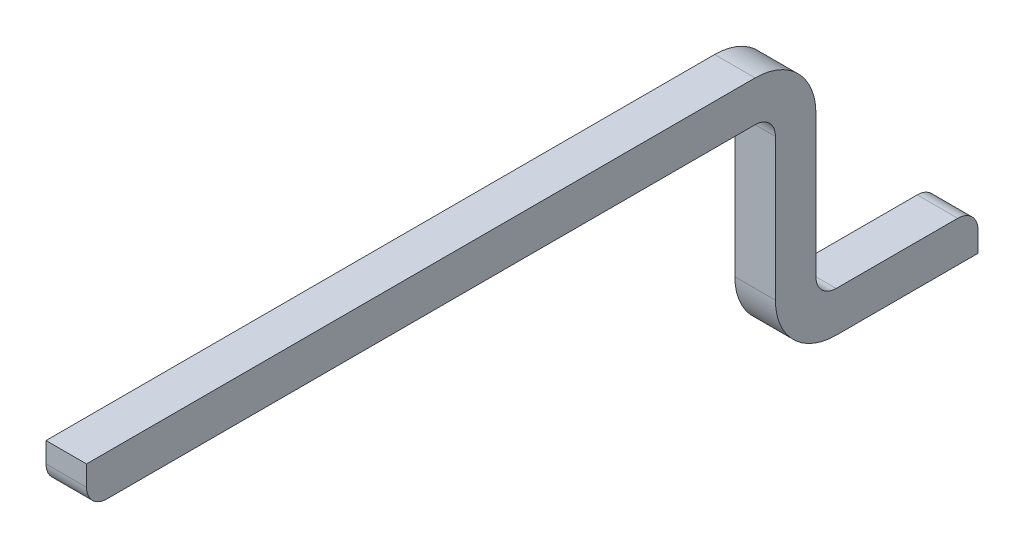
ISO-10303-21;
HEADER;
FILE_DESCRIPTION(('STEP AP214'),'2;1');
FILE_NAME('part.step','',(''),(''),'','','');
FILE_SCHEMA(('AUTOMOTIVE_DESIGN { 1 0 10303 214 1 1 1 1 }'));
ENDSEC;
DATA;
#1=APPLICATION_CONTEXT('core data for automotive mechanical design processes');
#2=APPLICATION_PROTOCOL_DEFINITION('international standard','automotive_design',2000,#1);
#3=PRODUCT_CONTEXT('',#1,'mechanical');
#4=PRODUCT('Part','Part','',(#3));
#5=PRODUCT_RELATED_PRODUCT_CATEGORY('part','',(#4));
#6=PRODUCT_DEFINITION_FORMATION('','',#4);
#7=PRODUCT_DEFINITION_CONTEXT('part definition',#1,'design');
#8=PRODUCT_DEFINITION('design','',#6,#7);
#9=PRODUCT_DEFINITION_SHAPE('','',#8);
#10=(LENGTH_UNIT() NAMED_UNIT(*) SI_UNIT(.MILLI.,.METRE.));
#11=(NAMED_UNIT(*) PLANE_ANGLE_UNIT() SI_UNIT($,.RADIAN.));
#12=(NAMED_UNIT(*) SI_UNIT($,.STERADIAN.) SOLID_ANGLE_UNIT());
#13=UNCERTAINTY_MEASURE_WITH_UNIT(LENGTH_MEASURE(1.E-05),#10,'distance_accuracy_value','');
#14=(GEOMETRIC_REPRESENTATION_CONTEXT(3) GLOBAL_UNCERTAINTY_ASSIGNED_CONTEXT((#13)) GLOBAL_UNIT_ASSIGNED_CONTEXT((#10,
#11,#12)) REPRESENTATION_CONTEXT('',''));
#15=CARTESIAN_POINT('',(0.,0.,0.));
#16=DIRECTION('',(0.,0.,1.));
#17=DIRECTION('',(1.,0.,0.));
#18=AXIS2_PLACEMENT_3D('',#15,#16,#17);
#19=CARTESIAN_POINT('',(0.1,0.3,-4.5));
#20=DIRECTION('',(1.,0.,0.));
#21=DIRECTION('',(0.,0.,-1.));
#22=AXIS2_PLACEMENT_3D('',#19,#20,#21);
#23=PLANE('',#22);
#24=CARTESIAN_POINT('',(0.1,0.3,-4.5));
#25=DIRECTION('',(-1.,0.,0.));
#26=DIRECTION('',(0.,0.,1.));
#27=AXIS2_PLACEMENT_3D('',#24,#25,#26);
#28=CIRCLE('',#27,0.3);
#29=CARTESIAN_POINT('',(0.1,0.3,-4.2));
#30=VERTEX_POINT('',#29);
#31=CARTESIAN_POINT('',(0.1,0.,-4.5));
#32=VERTEX_POINT('',#31);
#33=EDGE_CURVE('E240',#30,#32,#28,.F.);
#34=ORIENTED_EDGE('',*,*,#33,.T.);
#35=DIRECTION('',(0.,0.,-1.));
#36=VECTOR('',#35,1.);
#37=CARTESIAN_POINT('',(0.1,0.,-4.5));
#38=LINE('',#37,#36);
#39=CARTESIAN_POINT('',(0.1,0.,-5.2));
#40=VERTEX_POINT('',#39);
#41=EDGE_CURVE('E112',#32,#40,#38,.T.);
#42=ORIENTED_EDGE('',*,*,#41,.T.);
#43=DIRECTION('',(0.,1.,0.));
#44=VECTOR('',#43,1.);
#45=CARTESIAN_POINT('',(0.1,0.3,-5.2));
#46=LINE('',#45,#44);
#47=CARTESIAN_POINT('',(0.1,0.1,-5.2));
#48=VERTEX_POINT('',#47);
#49=EDGE_CURVE('E109',#40,#48,#46,.T.);
#50=ORIENTED_EDGE('',*,*,#49,.T.);
#51=CARTESIAN_POINT('',(0.1,0.1,-5.1));
#52=DIRECTION('',(-1.,0.,0.));
#53=DIRECTION('',(0.,0.,1.));
#54=AXIS2_PLACEMENT_3D('',#51,#52,#53);
#55=CIRCLE('',#54,0.1);
#56=CARTESIAN_POINT('',(0.1,0.2,-5.1));
#57=VERTEX_POINT('',#56);
#58=EDGE_CURVE('E19',#48,#57,#55,.F.);
#59=ORIENTED_EDGE('',*,*,#58,.T.);
#60=DIRECTION('',(0.,0.,-1.));
#61=VECTOR('',#60,1.);
#62=CARTESIAN_POINT('',(0.1,0.2,-4.5));
#63=LINE('',#62,#61);
#64=CARTESIAN_POINT('',(0.1,0.2,-4.5));
#65=VERTEX_POINT('',#64);
#66=EDGE_CURVE('E247',#57,#65,#63,.F.);
#67=ORIENTED_EDGE('',*,*,#66,.T.);
#68=CARTESIAN_POINT('',(0.1,0.3,-4.5));
#69=DIRECTION('',(-1.,0.,0.));
#70=DIRECTION('',(0.,0.,1.));
#71=AXIS2_PLACEMENT_3D('',#68,#69,#70);
#72=CIRCLE('',#71,0.1);
#73=CARTESIAN_POINT('',(0.1,0.3,-4.4));
#74=VERTEX_POINT('',#73);
#75=EDGE_CURVE('E239',#65,#74,#72,.T.);
#76=ORIENTED_EDGE('',*,*,#75,.T.);
#77=DIRECTION('',(0.,1.,0.));
#78=VECTOR('',#77,1.);
#79=CARTESIAN_POINT('',(0.1,1.,-4.4));
#80=LINE('',#79,#78);
#81=CARTESIAN_POINT('',(0.1,1.,-4.4));
#82=VERTEX_POINT('',#81);
#83=EDGE_CURVE('E233',#82,#74,#80,.F.);
#84=ORIENTED_EDGE('',*,*,#83,.F.);
#85=CARTESIAN_POINT('',(0.1,1.,-4.1));
#86=DIRECTION('',(-1.,0.,0.));
#87=DIRECTION('',(0.,0.,1.));
#88=AXIS2_PLACEMENT_3D('',#85,#86,#87);
#89=CIRCLE('',#88,0.3);
#90=CARTESIAN_POINT('',(0.1,1.3,-4.1));
#91=VERTEX_POINT('',#90);
#92=EDGE_CURVE('E229',#91,#82,#89,.T.);
#93=ORIENTED_EDGE('',*,*,#92,.F.);
#94=DIRECTION('',(0.,0.,1.));
#95=VECTOR('',#94,1.);
#96=CARTESIAN_POINT('',(0.1,1.3,-0.8));
#97=LINE('',#96,#95);
#98=CARTESIAN_POINT('',(0.1,1.3,-0.8));
#99=VERTEX_POINT('',#98);
#100=EDGE_CURVE('E225',#99,#91,#97,.F.);
#101=ORIENTED_EDGE('',*,*,#100,.F.);
#102=DIRECTION('',(0.,-1.,0.));
#103=VECTOR('',#102,1.);
#104=CARTESIAN_POINT('',(0.1,1.1,-0.8));
#105=LINE('',#104,#103);
#106=CARTESIAN_POINT('',(0.1,1.2,-0.8));
#107=VERTEX_POINT('',#106);
#108=EDGE_CURVE('E219',#107,#99,#105,.F.);
#109=ORIENTED_EDGE('',*,*,#108,.F.);
#110=CARTESIAN_POINT('',(0.1,1.2,-0.9));
#111=DIRECTION('',(1.,0.,0.));
#112=DIRECTION('',(0.,0.,-1.));
#113=AXIS2_PLACEMENT_3D('',#110,#111,#112);
#114=CIRCLE('',#113,0.1);
#115=CARTESIAN_POINT('',(0.1,1.1,-0.9));
#116=VERTEX_POINT('',#115);
#117=EDGE_CURVE('E215',#116,#107,#114,.F.);
#118=ORIENTED_EDGE('',*,*,#117,.F.);
#119=DIRECTION('',(0.,0.,1.));
#120=VECTOR('',#119,1.);
#121=CARTESIAN_POINT('',(0.1,1.1,-0.8));
#122=LINE('',#121,#120);
#123=CARTESIAN_POINT('',(0.1,1.1,-4.1));
#124=VERTEX_POINT('',#123);
#125=EDGE_CURVE('E207',#116,#124,#122,.F.);
#126=ORIENTED_EDGE('',*,*,#125,.T.);
#127=CARTESIAN_POINT('',(0.1,1.,-4.1));
#128=DIRECTION('',(-1.,0.,0.));
#129=DIRECTION('',(0.,0.,1.));
#130=AXIS2_PLACEMENT_3D('',#127,#128,#129);
#131=CIRCLE('',#130,0.1);
#132=CARTESIAN_POINT('',(0.1,1.,-4.2));
#133=VERTEX_POINT('',#132);
#134=EDGE_CURVE('E246',#124,#133,#131,.T.);
#135=ORIENTED_EDGE('',*,*,#134,.T.);
#136=DIRECTION('',(0.,1.,0.));
#137=VECTOR('',#136,1.);
#138=CARTESIAN_POINT('',(0.1,0.3,-4.2));
#139=LINE('',#138,#137);
#140=EDGE_CURVE('E243',#133,#30,#139,.F.);
#141=ORIENTED_EDGE('',*,*,#140,.T.);
#142=EDGE_LOOP('',(#34,#42,#50,#59,#67,#76,#84,#93,#101,#109,#118,#126,#135,#141));
#143=FACE_BOUND('',#142,.T.);
#144=ADVANCED_FACE('F16',(#143),#23,.T.);
#145=CARTESIAN_POINT('',(0.1,0.3,-4.5));
#146=DIRECTION('',(-1.,0.,0.));
#147=DIRECTION('',(0.,0.,1.));
#148=AXIS2_PLACEMENT_3D('',#145,#146,#147);
#149=CYLINDRICAL_SURFACE('',#148,0.1);
#150=DIRECTION('',(-1.,0.,0.));
#151=VECTOR('',#150,1.);
#152=CARTESIAN_POINT('',(0.1,0.3,-4.4));
#153=LINE('',#152,#151);
#154=CARTESIAN_POINT('',(-0.1,0.3,-4.4));
#155=VERTEX_POINT('',#154);
#156=EDGE_CURVE('E230',#74,#155,#153,.T.);
#157=ORIENTED_EDGE('',*,*,#156,.F.);
#158=ORIENTED_EDGE('',*,*,#75,.F.);
#159=DIRECTION('',(1.,0.,0.));
#160=VECTOR('',#159,1.);
#161=CARTESIAN_POINT('',(0.1,0.2,-4.5));
#162=LINE('',#161,#160);
#163=CARTESIAN_POINT('',(-0.1,0.2,-4.5));
#164=VERTEX_POINT('',#163);
#165=EDGE_CURVE('E186',#164,#65,#162,.T.);
#166=ORIENTED_EDGE('',*,*,#165,.F.);
#167=CARTESIAN_POINT('',(-0.1,0.3,-4.5));
#168=DIRECTION('',(-1.,0.,0.));
#169=DIRECTION('',(0.,0.,1.));
#170=AXIS2_PLACEMENT_3D('',#167,#168,#169);
#171=CIRCLE('',#170,0.1);
#172=EDGE_CURVE('E183',#164,#155,#171,.T.);
#173=ORIENTED_EDGE('',*,*,#172,.T.);
#174=EDGE_LOOP('',(#157,#158,#166,#173));
#175=FACE_BOUND('',#174,.T.);
#176=ADVANCED_FACE('F327',(#175),#149,.F.);
#177=CARTESIAN_POINT('',(0.1,1.,-4.4));
#178=DIRECTION('',(0.,0.,-1.));
#179=DIRECTION('',(-1.,0.,0.));
#180=AXIS2_PLACEMENT_3D('',#177,#178,#179);
#181=PLANE('',#180);
#182=ORIENTED_EDGE('',*,*,#83,.T.);
#183=ORIENTED_EDGE('',*,*,#156,.T.);
#184=DIRECTION('',(0.,1.,0.));
#185=VECTOR('',#184,1.);
#186=CARTESIAN_POINT('',(-0.1,0.3,-4.4));
#187=LINE('',#186,#185);
#188=CARTESIAN_POINT('',(-0.1,1.,-4.4));
#189=VERTEX_POINT('',#188);
#190=EDGE_CURVE('E180',#155,#189,#187,.T.);
#191=ORIENTED_EDGE('',*,*,#190,.T.);
#192=DIRECTION('',(-1.,0.,0.));
#193=VECTOR('',#192,1.);
#194=CARTESIAN_POINT('',(0.1,1.,-4.4));
#195=LINE('',#194,#193);
#196=EDGE_CURVE('E226',#82,#189,#195,.T.);
#197=ORIENTED_EDGE('',*,*,#196,.F.);
#198=EDGE_LOOP('',(#182,#183,#191,#197));
#199=FACE_BOUND('',#198,.T.);
#200=ADVANCED_FACE('F323',(#199),#181,.T.);
#201=CARTESIAN_POINT('',(0.1,1.,-4.1));
#202=DIRECTION('',(-1.,0.,0.));
#203=DIRECTION('',(0.,0.,1.));
#204=AXIS2_PLACEMENT_3D('',#201,#202,#203);
#205=CYLINDRICAL_SURFACE('',#204,0.3);
#206=ORIENTED_EDGE('',*,*,#92,.T.);
#207=ORIENTED_EDGE('',*,*,#196,.T.);
#208=CARTESIAN_POINT('',(-0.1,1.,-4.1));
#209=DIRECTION('',(-1.,0.,0.));
#210=DIRECTION('',(0.,0.,1.));
#211=AXIS2_PLACEMENT_3D('',#208,#209,#210);
#212=CIRCLE('',#211,0.3);
#213=CARTESIAN_POINT('',(-0.1,1.3,-4.1));
#214=VERTEX_POINT('',#213);
#215=EDGE_CURVE('E177',#189,#214,#212,.F.);
#216=ORIENTED_EDGE('',*,*,#215,.T.);
#217=DIRECTION('',(1.,0.,0.));
#218=VECTOR('',#217,1.);
#219=CARTESIAN_POINT('',(0.1,1.3,-4.1));
#220=LINE('',#219,#218);
#221=EDGE_CURVE('E222',#91,#214,#220,.F.);
#222=ORIENTED_EDGE('',*,*,#221,.F.);
#223=EDGE_LOOP('',(#206,#207,#216,#222));
#224=FACE_BOUND('',#223,.T.);
#225=ADVANCED_FACE('F319',(#224),#205,.T.);
#226=CARTESIAN_POINT('',(0.1,1.3,-0.8));
#227=DIRECTION('',(0.,1.,0.));
#228=DIRECTION('',(0.,0.,1.));
#229=AXIS2_PLACEMENT_3D('',#226,#227,#228);
#230=PLANE('',#229);
#231=ORIENTED_EDGE('',*,*,#100,.T.);
#232=ORIENTED_EDGE('',*,*,#221,.T.);
#233=DIRECTION('',(0.,0.,-1.));
#234=VECTOR('',#233,1.);
#235=CARTESIAN_POINT('',(-0.1,1.3,-4.5));
#236=LINE('',#235,#234);
#237=CARTESIAN_POINT('',(-0.1,1.3,-0.8));
#238=VERTEX_POINT('',#237);
#239=EDGE_CURVE('E171',#214,#238,#236,.F.);
#240=ORIENTED_EDGE('',*,*,#239,.T.);
#241=DIRECTION('',(1.,0.,0.));
#242=VECTOR('',#241,1.);
#243=CARTESIAN_POINT('',(0.1,1.3,-0.8));
#244=LINE('',#243,#242);
#245=EDGE_CURVE('E216',#99,#238,#244,.F.);
#246=ORIENTED_EDGE('',*,*,#245,.F.);
#247=EDGE_LOOP('',(#231,#232,#240,#246));
#248=FACE_BOUND('',#247,.T.);
#249=ADVANCED_FACE('F313',(#248),#230,.T.);
#250=CARTESIAN_POINT('',(0.1,1.1,-0.8));
#251=DIRECTION('',(0.,0.,1.));
#252=DIRECTION('',(0.,-1.,0.));
#253=AXIS2_PLACEMENT_3D('',#250,#251,#252);
#254=PLANE('',#253);
#255=ORIENTED_EDGE('',*,*,#108,.T.);
#256=ORIENTED_EDGE('',*,*,#245,.T.);
#257=DIRECTION('',(0.,1.,0.));
#258=VECTOR('',#257,1.);
#259=CARTESIAN_POINT('',(-0.1,0.3,-0.8));
#260=LINE('',#259,#258);
#261=CARTESIAN_POINT('',(-0.1,1.2,-0.8));
#262=VERTEX_POINT('',#261);
#263=EDGE_CURVE('E167',#238,#262,#260,.F.);
#264=ORIENTED_EDGE('',*,*,#263,.T.);
#265=DIRECTION('',(1.,0.,0.));
#266=VECTOR('',#265,1.);
#267=CARTESIAN_POINT('',(0.1,1.2,-0.8));
#268=LINE('',#267,#266);
#269=EDGE_CURVE('E212',#107,#262,#268,.F.);
#270=ORIENTED_EDGE('',*,*,#269,.F.);
#271=EDGE_LOOP('',(#255,#256,#264,#270));
#272=FACE_BOUND('',#271,.T.);
#273=ADVANCED_FACE('F309',(#272),#254,.T.);
#274=CARTESIAN_POINT('',(0.1,1.2,-0.9));
#275=DIRECTION('',(1.,0.,0.));
#276=DIRECTION('',(0.,0.,-1.));
#277=AXIS2_PLACEMENT_3D('',#274,#275,#276);
#278=CYLINDRICAL_SURFACE('',#277,0.1);
#279=CARTESIAN_POINT('',(-0.1,1.2,-0.9));
#280=DIRECTION('',(1.,0.,0.));
#281=DIRECTION('',(0.,0.,-1.));
#282=AXIS2_PLACEMENT_3D('',#279,#280,#281);
#283=CIRCLE('',#282,0.1);
#284=CARTESIAN_POINT('',(-0.1,1.1,-0.9));
#285=VERTEX_POINT('',#284);
#286=EDGE_CURVE('E166',#262,#285,#283,.T.);
#287=ORIENTED_EDGE('',*,*,#286,.T.);
#288=DIRECTION('',(1.,0.,0.));
#289=VECTOR('',#288,1.);
#290=CARTESIAN_POINT('',(0.1,1.1,-0.9));
#291=LINE('',#290,#289);
#292=EDGE_CURVE('E208',#285,#116,#291,.T.);
#293=ORIENTED_EDGE('',*,*,#292,.T.);
#294=ORIENTED_EDGE('',*,*,#117,.T.);
#295=ORIENTED_EDGE('',*,*,#269,.T.);
#296=EDGE_LOOP('',(#287,#293,#294,#295));
#297=FACE_BOUND('',#296,.T.);
#298=ADVANCED_FACE('F303',(#297),#278,.T.);
#299=CARTESIAN_POINT('',(0.1,1.1,-0.8));
#300=DIRECTION('',(0.,1.,0.));
#301=DIRECTION('',(0.,0.,1.));
#302=AXIS2_PLACEMENT_3D('',#299,#300,#301);
#303=PLANE('',#302);
#304=ORIENTED_EDGE('',*,*,#292,.F.);
#305=DIRECTION('',(0.,0.,-1.));
#306=VECTOR('',#305,1.);
#307=CARTESIAN_POINT('',(-0.1,1.1,-4.5));
#308=LINE('',#307,#306);
#309=CARTESIAN_POINT('',(-0.1,1.1,-4.1));
#310=VERTEX_POINT('',#309);
#311=EDGE_CURVE('E162',#285,#310,#308,.T.);
#312=ORIENTED_EDGE('',*,*,#311,.T.);
#313=DIRECTION('',(-1.,0.,0.));
#314=VECTOR('',#313,1.);
#315=CARTESIAN_POINT('',(0.1,1.1,-4.1));
#316=LINE('',#315,#314);
#317=EDGE_CURVE('E203',#310,#124,#316,.F.);
#318=ORIENTED_EDGE('',*,*,#317,.T.);
#319=ORIENTED_EDGE('',*,*,#125,.F.);
#320=EDGE_LOOP('',(#304,#312,#318,#319));
#321=FACE_BOUND('',#320,.T.);
#322=ADVANCED_FACE('F301',(#321),#303,.F.);
#323=CARTESIAN_POINT('',(0.1,1.,-4.1));
#324=DIRECTION('',(-1.,0.,0.));
#325=DIRECTION('',(0.,0.,1.));
#326=AXIS2_PLACEMENT_3D('',#323,#324,#325);
#327=CYLINDRICAL_SURFACE('',#326,0.1);
#328=DIRECTION('',(-1.,0.,0.));
#329=VECTOR('',#328,1.);
#330=CARTESIAN_POINT('',(0.1,1.,-4.2));
#331=LINE('',#330,#329);
#332=CARTESIAN_POINT('',(-0.1,1.,-4.2));
#333=VERTEX_POINT('',#332);
#334=EDGE_CURVE('E199',#333,#133,#331,.F.);
#335=ORIENTED_EDGE('',*,*,#334,.T.);
#336=ORIENTED_EDGE('',*,*,#134,.F.);
#337=ORIENTED_EDGE('',*,*,#317,.F.);
#338=CARTESIAN_POINT('',(-0.1,1.,-4.1));
#339=DIRECTION('',(-1.,0.,0.));
#340=DIRECTION('',(0.,0.,1.));
#341=AXIS2_PLACEMENT_3D('',#338,#339,#340);
#342=CIRCLE('',#341,0.1);
#343=EDGE_CURVE('E161',#310,#333,#342,.T.);
#344=ORIENTED_EDGE('',*,*,#343,.T.);
#345=EDGE_LOOP('',(#335,#336,#337,#344));
#346=FACE_BOUND('',#345,.T.);
#347=ADVANCED_FACE('F290',(#346),#327,.F.);
#348=CARTESIAN_POINT('',(0.1,1.,-4.2));
#349=DIRECTION('',(0.,0.,-1.));
#350=DIRECTION('',(-1.,0.,0.));
#351=AXIS2_PLACEMENT_3D('',#348,#349,#350);
#352=PLANE('',#351);
#353=DIRECTION('',(-1.,0.,0.));
#354=VECTOR('',#353,1.);
#355=CARTESIAN_POINT('',(0.1,0.3,-4.2));
#356=LINE('',#355,#354);
#357=CARTESIAN_POINT('',(-0.1,0.3,-4.2));
#358=VERTEX_POINT('',#357);
#359=EDGE_CURVE('E196',#30,#358,#356,.T.);
#360=ORIENTED_EDGE('',*,*,#359,.F.);
#361=ORIENTED_EDGE('',*,*,#140,.F.);
#362=ORIENTED_EDGE('',*,*,#334,.F.);
#363=DIRECTION('',(0.,1.,0.));
#364=VECTOR('',#363,1.);
#365=CARTESIAN_POINT('',(-0.1,0.3,-4.2));
#366=LINE('',#365,#364);
#367=EDGE_CURVE('E151',#333,#358,#366,.F.);
#368=ORIENTED_EDGE('',*,*,#367,.T.);
#369=EDGE_LOOP('',(#360,#361,#362,#368));
#370=FACE_BOUND('',#369,.T.);
#371=ADVANCED_FACE('F294',(#370),#352,.F.);
#372=CARTESIAN_POINT('',(0.1,0.3,-4.5));
#373=DIRECTION('',(-1.,0.,0.));
#374=DIRECTION('',(0.,0.,1.));
#375=AXIS2_PLACEMENT_3D('',#372,#373,#374);
#376=CYLINDRICAL_SURFACE('',#375,0.3);
#377=ORIENTED_EDGE('',*,*,#33,.F.);
#378=ORIENTED_EDGE('',*,*,#359,.T.);
#379=CARTESIAN_POINT('',(-0.1,0.3,-4.5));
#380=DIRECTION('',(-1.,0.,0.));
#381=DIRECTION('',(0.,0.,1.));
#382=AXIS2_PLACEMENT_3D('',#379,#380,#381);
#383=CIRCLE('',#382,0.3);
#384=CARTESIAN_POINT('',(-0.1,0.,-4.5));
#385=VERTEX_POINT('',#384);
#386=EDGE_CURVE('E145',#358,#385,#383,.F.);
#387=ORIENTED_EDGE('',*,*,#386,.T.);
#388=DIRECTION('',(1.,0.,0.));
#389=VECTOR('',#388,1.);
#390=CARTESIAN_POINT('',(0.1,0.,-4.5));
#391=LINE('',#390,#389);
#392=EDGE_CURVE('E130',#385,#32,#391,.T.);
#393=ORIENTED_EDGE('',*,*,#392,.T.);
#394=EDGE_LOOP('',(#377,#378,#387,#393));
#395=FACE_BOUND('',#394,.T.);
#396=ADVANCED_FACE('F297',(#395),#376,.T.);
#397=CARTESIAN_POINT('',(0.1,0.,-4.5));
#398=DIRECTION('',(0.,1.,0.));
#399=DIRECTION('',(0.,0.,1.));
#400=AXIS2_PLACEMENT_3D('',#397,#398,#399);
#401=PLANE('',#400);
#402=DIRECTION('',(-1.,0.,0.));
#403=VECTOR('',#402,1.);
#404=CARTESIAN_POINT('',(0.1,0.,-5.2));
#405=LINE('',#404,#403);
#406=CARTESIAN_POINT('',(-0.1,0.,-5.2));
#407=VERTEX_POINT('',#406);
#408=EDGE_CURVE('E122',#40,#407,#405,.T.);
#409=ORIENTED_EDGE('',*,*,#408,.F.);
#410=ORIENTED_EDGE('',*,*,#41,.F.);
#411=ORIENTED_EDGE('',*,*,#392,.F.);
#412=DIRECTION('',(0.,0.,-1.));
#413=VECTOR('',#412,1.);
#414=CARTESIAN_POINT('',(-0.1,0.,-4.5));
#415=LINE('',#414,#413);
#416=EDGE_CURVE('E137',#385,#407,#415,.T.);
#417=ORIENTED_EDGE('',*,*,#416,.T.);
#418=EDGE_LOOP('',(#409,#410,#411,#417));
#419=FACE_BOUND('',#418,.T.);
#420=ADVANCED_FACE('F142',(#419),#401,.F.);
#421=CARTESIAN_POINT('',(0.1,0.2,-5.2));
#422=DIRECTION('',(0.,0.,-1.));
#423=DIRECTION('',(-1.,0.,0.));
#424=AXIS2_PLACEMENT_3D('',#421,#422,#423);
#425=PLANE('',#424);
#426=ORIENTED_EDGE('',*,*,#49,.F.);
#427=ORIENTED_EDGE('',*,*,#408,.T.);
#428=DIRECTION('',(0.,1.,0.));
#429=VECTOR('',#428,1.);
#430=CARTESIAN_POINT('',(-0.1,0.3,-5.2));
#431=LINE('',#430,#429);
#432=CARTESIAN_POINT('',(-0.1,0.1,-5.2));
#433=VERTEX_POINT('',#432);
#434=EDGE_CURVE('E125',#407,#433,#431,.T.);
#435=ORIENTED_EDGE('',*,*,#434,.T.);
#436=DIRECTION('',(-1.,0.,0.));
#437=VECTOR('',#436,1.);
#438=CARTESIAN_POINT('',(0.1,0.1,-5.2));
#439=LINE('',#438,#437);
#440=EDGE_CURVE('E129',#48,#433,#439,.T.);
#441=ORIENTED_EDGE('',*,*,#440,.F.);
#442=EDGE_LOOP('',(#426,#427,#435,#441));
#443=FACE_BOUND('',#442,.T.);
#444=ADVANCED_FACE('F124',(#443),#425,.T.);
#445=CARTESIAN_POINT('',(0.1,0.1,-5.1));
#446=DIRECTION('',(-1.,0.,0.));
#447=DIRECTION('',(0.,0.,1.));
#448=AXIS2_PLACEMENT_3D('',#445,#446,#447);
#449=CYLINDRICAL_SURFACE('',#448,0.1);
#450=CARTESIAN_POINT('',(-0.1,0.1,-5.1));
#451=DIRECTION('',(-1.,0.,0.));
#452=DIRECTION('',(0.,0.,1.));
#453=AXIS2_PLACEMENT_3D('',#450,#451,#452);
#454=CIRCLE('',#453,0.1);
#455=CARTESIAN_POINT('',(-0.1,0.2,-5.1));
#456=VERTEX_POINT('',#455);
#457=EDGE_CURVE('E26',#433,#456,#454,.F.);
#458=ORIENTED_EDGE('',*,*,#457,.T.);
#459=DIRECTION('',(1.,0.,0.));
#460=VECTOR('',#459,1.);
#461=CARTESIAN_POINT('',(0.1,0.2,-5.1));
#462=LINE('',#461,#460);
#463=EDGE_CURVE('E34',#57,#456,#462,.F.);
#464=ORIENTED_EDGE('',*,*,#463,.F.);
#465=ORIENTED_EDGE('',*,*,#58,.F.);
#466=ORIENTED_EDGE('',*,*,#440,.T.);
#467=EDGE_LOOP('',(#458,#464,#465,#466));
#468=FACE_BOUND('',#467,.T.);
#469=ADVANCED_FACE('F331',(#468),#449,.T.);
#470=CARTESIAN_POINT('',(0.1,0.2,-4.5));
#471=DIRECTION('',(0.,1.,0.));
#472=DIRECTION('',(0.,0.,1.));
#473=AXIS2_PLACEMENT_3D('',#470,#471,#472);
#474=PLANE('',#473);
#475=DIRECTION('',(0.,0.,-1.));
#476=VECTOR('',#475,1.);
#477=CARTESIAN_POINT('',(-0.1,0.2,-4.5));
#478=LINE('',#477,#476);
#479=EDGE_CURVE('E11',#456,#164,#478,.F.);
#480=ORIENTED_EDGE('',*,*,#479,.T.);
#481=ORIENTED_EDGE('',*,*,#165,.T.);
#482=ORIENTED_EDGE('',*,*,#66,.F.);
#483=ORIENTED_EDGE('',*,*,#463,.T.);
#484=EDGE_LOOP('',(#480,#481,#482,#483));
#485=FACE_BOUND('',#484,.T.);
#486=ADVANCED_FACE('F329',(#485),#474,.T.);
#487=CARTESIAN_POINT('',(-0.1,0.3,-4.5));
#488=DIRECTION('',(1.,0.,0.));
#489=DIRECTION('',(0.,0.,-1.));
#490=AXIS2_PLACEMENT_3D('',#487,#488,#489);
#491=PLANE('',#490);
#492=ORIENTED_EDGE('',*,*,#457,.F.);
#493=ORIENTED_EDGE('',*,*,#434,.F.);
#494=ORIENTED_EDGE('',*,*,#416,.F.);
#495=ORIENTED_EDGE('',*,*,#386,.F.);
#496=ORIENTED_EDGE('',*,*,#367,.F.);
#497=ORIENTED_EDGE('',*,*,#343,.F.);
#498=ORIENTED_EDGE('',*,*,#311,.F.);
#499=ORIENTED_EDGE('',*,*,#286,.F.);
#500=ORIENTED_EDGE('',*,*,#263,.F.);
#501=ORIENTED_EDGE('',*,*,#239,.F.);
#502=ORIENTED_EDGE('',*,*,#215,.F.);
#503=ORIENTED_EDGE('',*,*,#190,.F.);
#504=ORIENTED_EDGE('',*,*,#172,.F.);
#505=ORIENTED_EDGE('',*,*,#479,.F.);
#506=EDGE_LOOP('',(#492,#493,#494,#495,#496,#497,#498,#499,#500,#501,#502,#503,#504,#505));
#507=FACE_BOUND('',#506,.T.);
#508=ADVANCED_FACE('F135',(#507),#491,.F.);
#509=CLOSED_SHELL('',(#144,#176,#200,#225,#249,#273,#298,#322,#347,#371,#396,#420,#444,#469,
#486,#508));
#510=MANIFOLD_SOLID_BREP('B1',#509);
#511=ADVANCED_BREP_SHAPE_REPRESENTATION('',(#18,#510),#14);
#512=SHAPE_DEFINITION_REPRESENTATION(#9,#511);
ENDSEC;
END-ISO-10303-21;
